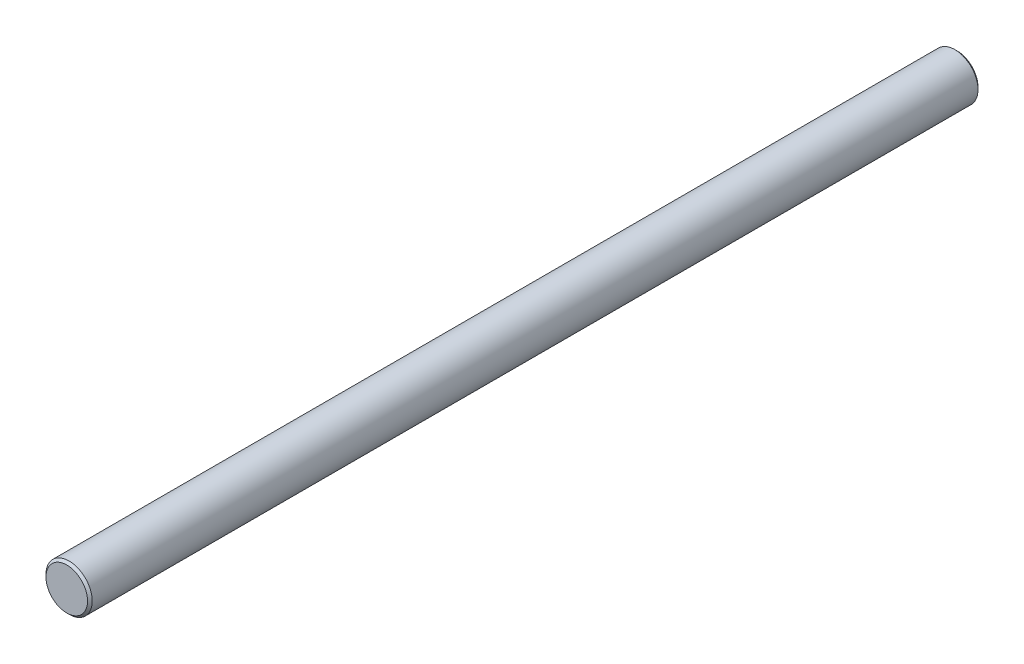
ISO-10303-21;
HEADER;
FILE_DESCRIPTION(('STEP AP214'),'2;1');
FILE_NAME('part.step','',(''),(''),'','','');
FILE_SCHEMA(('AUTOMOTIVE_DESIGN { 1 0 10303 214 1 1 1 1 }'));
ENDSEC;
DATA;
#1=APPLICATION_CONTEXT('core data for automotive mechanical design processes');
#2=APPLICATION_PROTOCOL_DEFINITION('international standard','automotive_design',2000,#1);
#3=PRODUCT_CONTEXT('',#1,'mechanical');
#4=PRODUCT('Part','Part','',(#3));
#5=PRODUCT_RELATED_PRODUCT_CATEGORY('part','',(#4));
#6=PRODUCT_DEFINITION_FORMATION('','',#4);
#7=PRODUCT_DEFINITION_CONTEXT('part definition',#1,'design');
#8=PRODUCT_DEFINITION('design','',#6,#7);
#9=PRODUCT_DEFINITION_SHAPE('','',#8);
#10=(LENGTH_UNIT() NAMED_UNIT(*) SI_UNIT(.MILLI.,.METRE.));
#11=(NAMED_UNIT(*) PLANE_ANGLE_UNIT() SI_UNIT($,.RADIAN.));
#12=(NAMED_UNIT(*) SI_UNIT($,.STERADIAN.) SOLID_ANGLE_UNIT());
#13=UNCERTAINTY_MEASURE_WITH_UNIT(LENGTH_MEASURE(1.E-05),#10,'distance_accuracy_value','');
#14=(GEOMETRIC_REPRESENTATION_CONTEXT(3) GLOBAL_UNCERTAINTY_ASSIGNED_CONTEXT((#13)) GLOBAL_UNIT_ASSIGNED_CONTEXT((#10,
#11,#12)) REPRESENTATION_CONTEXT('',''));
#15=CARTESIAN_POINT('',(0.,0.,0.));
#16=DIRECTION('',(0.,0.,1.));
#17=DIRECTION('',(1.,0.,0.));
#18=AXIS2_PLACEMENT_3D('',#15,#16,#17);
#19=CARTESIAN_POINT('',(0.,0.,385.));
#20=DIRECTION('',(0.,0.,-1.));
#21=DIRECTION('',(-1.,0.,0.));
#22=AXIS2_PLACEMENT_3D('',#19,#20,#21);
#23=CYLINDRICAL_SURFACE('',#22,10.);
#24=CARTESIAN_POINT('',(0.,0.,0.999999999999945));
#25=DIRECTION('',(0.,0.,1.));
#26=DIRECTION('',(1.,0.,0.));
#27=AXIS2_PLACEMENT_3D('',#24,#25,#26);
#28=CIRCLE('',#27,10.);
#29=CARTESIAN_POINT('',(10.,0.,0.999999999999945));
#30=VERTEX_POINT('',#29);
#31=EDGE_CURVE('E53',#30,#30,#28,.T.);
#32=ORIENTED_EDGE('',*,*,#31,.T.);
#33=EDGE_LOOP('',(#32));
#34=FACE_BOUND('',#33,.T.);
#35=CARTESIAN_POINT('',(0.,0.,384.));
#36=DIRECTION('',(0.,0.,1.));
#37=DIRECTION('',(1.,0.,0.));
#38=AXIS2_PLACEMENT_3D('',#35,#36,#37);
#39=CIRCLE('',#38,10.);
#40=CARTESIAN_POINT('',(10.,0.,384.));
#41=VERTEX_POINT('',#40);
#42=EDGE_CURVE('E58',#41,#41,#39,.F.);
#43=ORIENTED_EDGE('',*,*,#42,.T.);
#44=EDGE_LOOP('',(#43));
#45=FACE_BOUND('',#44,.T.);
#46=ADVANCED_FACE('F39',(#34,#45),#23,.T.);
#47=CARTESIAN_POINT('',(0.,0.,385.));
#48=DIRECTION('',(0.,0.,1.));
#49=DIRECTION('',(1.,0.,0.));
#50=AXIS2_PLACEMENT_3D('',#47,#48,#49);
#51=PLANE('',#50);
#52=CARTESIAN_POINT('',(0.,0.,385.));
#53=DIRECTION('',(0.,0.,1.));
#54=DIRECTION('',(1.,0.,0.));
#55=AXIS2_PLACEMENT_3D('',#52,#53,#54);
#56=CIRCLE('',#55,8.99999999999995);
#57=CARTESIAN_POINT('',(8.99999999999995,0.,385.));
#58=VERTEX_POINT('',#57);
#59=EDGE_CURVE('E10',#58,#58,#56,.T.);
#60=ORIENTED_EDGE('',*,*,#59,.T.);
#61=EDGE_LOOP('',(#60));
#62=FACE_BOUND('',#61,.T.);
#63=ADVANCED_FACE('F75',(#62),#51,.T.);
#64=CARTESIAN_POINT('',(0.,0.,0.));
#65=DIRECTION('',(0.,0.,1.));
#66=DIRECTION('',(1.,0.,0.));
#67=AXIS2_PLACEMENT_3D('',#64,#65,#66);
#68=PLANE('',#67);
#69=CARTESIAN_POINT('',(0.,0.,0.));
#70=DIRECTION('',(0.,0.,1.));
#71=DIRECTION('',(1.,0.,0.));
#72=AXIS2_PLACEMENT_3D('',#69,#70,#71);
#73=CIRCLE('',#72,9.00000000000006);
#74=CARTESIAN_POINT('',(9.00000000000006,0.,0.));
#75=VERTEX_POINT('',#74);
#76=EDGE_CURVE('E48',#75,#75,#73,.F.);
#77=ORIENTED_EDGE('',*,*,#76,.T.);
#78=EDGE_LOOP('',(#77));
#79=FACE_BOUND('',#78,.T.);
#80=ADVANCED_FACE('F72',(#79),#68,.F.);
#81=CARTESIAN_POINT('',(0.,0.,0.999999999999945));
#82=DIRECTION('',(0.,0.,1.));
#83=DIRECTION('',(1.,0.,0.));
#84=AXIS2_PLACEMENT_3D('',#81,#82,#83);
#85=CONICAL_SURFACE('',#84,10.,0.785398163397444);
#86=ORIENTED_EDGE('',*,*,#76,.F.);
#87=EDGE_LOOP('',(#86));
#88=FACE_BOUND('',#87,.T.);
#89=ORIENTED_EDGE('',*,*,#31,.F.);
#90=EDGE_LOOP('',(#89));
#91=FACE_BOUND('',#90,.T.);
#92=ADVANCED_FACE('F68',(#88,#91),#85,.T.);
#93=CARTESIAN_POINT('',(0.,0.,385.));
#94=DIRECTION('',(0.,0.,-1.));
#95=DIRECTION('',(-1.,0.,0.));
#96=AXIS2_PLACEMENT_3D('',#93,#94,#95);
#97=CONICAL_SURFACE('',#96,8.99999999999995,0.785398163397472);
#98=ORIENTED_EDGE('',*,*,#42,.F.);
#99=EDGE_LOOP('',(#98));
#100=FACE_BOUND('',#99,.T.);
#101=ORIENTED_EDGE('',*,*,#59,.F.);
#102=EDGE_LOOP('',(#101));
#103=FACE_BOUND('',#102,.T.);
#104=ADVANCED_FACE('F42',(#100,#103),#97,.T.);
#105=CLOSED_SHELL('',(#46,#63,#80,#92,#104));
#106=MANIFOLD_SOLID_BREP('B2',#105);
#107=ADVANCED_BREP_SHAPE_REPRESENTATION('',(#18,#106),#14);
#108=SHAPE_DEFINITION_REPRESENTATION(#9,#107);
ENDSEC;
END-ISO-10303-21;
